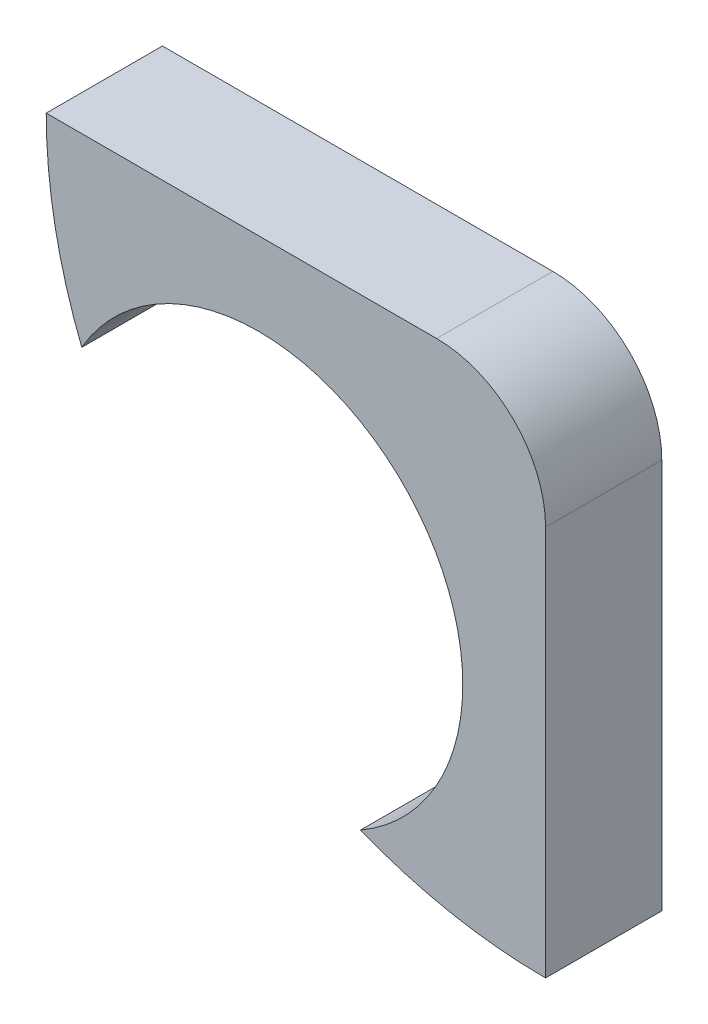
ISO-10303-21;
HEADER;
FILE_DESCRIPTION(('STEP AP214'),'2;1');
FILE_NAME('part.step','',(''),(''),'','','');
FILE_SCHEMA(('AUTOMOTIVE_DESIGN { 1 0 10303 214 1 1 1 1 }'));
ENDSEC;
DATA;
#1=APPLICATION_CONTEXT('core data for automotive mechanical design processes');
#2=APPLICATION_PROTOCOL_DEFINITION('international standard','automotive_design',2000,#1);
#3=PRODUCT_CONTEXT('',#1,'mechanical');
#4=PRODUCT('Part','Part','',(#3));
#5=PRODUCT_RELATED_PRODUCT_CATEGORY('part','',(#4));
#6=PRODUCT_DEFINITION_FORMATION('','',#4);
#7=PRODUCT_DEFINITION_CONTEXT('part definition',#1,'design');
#8=PRODUCT_DEFINITION('design','',#6,#7);
#9=PRODUCT_DEFINITION_SHAPE('','',#8);
#10=(LENGTH_UNIT() NAMED_UNIT(*) SI_UNIT(.MILLI.,.METRE.));
#11=(NAMED_UNIT(*) PLANE_ANGLE_UNIT() SI_UNIT($,.RADIAN.));
#12=(NAMED_UNIT(*) SI_UNIT($,.STERADIAN.) SOLID_ANGLE_UNIT());
#13=UNCERTAINTY_MEASURE_WITH_UNIT(LENGTH_MEASURE(1.E-05),#10,'distance_accuracy_value','');
#14=(GEOMETRIC_REPRESENTATION_CONTEXT(3) GLOBAL_UNCERTAINTY_ASSIGNED_CONTEXT((#13)) GLOBAL_UNIT_ASSIGNED_CONTEXT((#10,
#11,#12)) REPRESENTATION_CONTEXT('',''));
#15=CARTESIAN_POINT('',(0.,0.,0.));
#16=DIRECTION('',(0.,0.,1.));
#17=DIRECTION('',(1.,0.,0.));
#18=AXIS2_PLACEMENT_3D('',#15,#16,#17);
#19=CARTESIAN_POINT('',(19.95,19.95,18.95));
#20=DIRECTION('',(0.,0.,1.));
#21=DIRECTION('',(1.,0.,0.));
#22=AXIS2_PLACEMENT_3D('',#19,#20,#21);
#23=PLANE('',#22);
#24=CARTESIAN_POINT('',(19.95,19.95,18.95));
#25=DIRECTION('',(0.,0.,1.));
#26=DIRECTION('',(1.,0.,0.));
#27=AXIS2_PLACEMENT_3D('',#24,#25,#26);
#28=CIRCLE('',#27,6.875);
#29=CARTESIAN_POINT('',(17.4018583423999,13.5646574803852,18.95));
#30=VERTEX_POINT('',#29);
#31=CARTESIAN_POINT('',(19.95,13.0750000000002,18.95));
#32=VERTEX_POINT('',#31);
#33=EDGE_CURVE('E85',#30,#32,#28,.T.);
#34=ORIENTED_EDGE('',*,*,#33,.F.);
#35=CARTESIAN_POINT('',(16.,16.,18.95));
#36=DIRECTION('',(0.,0.,-1.));
#37=DIRECTION('',(1.,0.,0.));
#38=AXIS2_PLACEMENT_3D('',#35,#36,#37);
#39=CIRCLE('',#38,2.81);
#40=CARTESIAN_POINT('',(13.564657480385,17.4018583423996,18.95));
#41=VERTEX_POINT('',#40);
#42=EDGE_CURVE('E28',#41,#30,#39,.T.);
#43=ORIENTED_EDGE('',*,*,#42,.F.);
#44=CARTESIAN_POINT('',(19.95,19.95,18.95));
#45=DIRECTION('',(0.,0.,1.));
#46=DIRECTION('',(1.,0.,0.));
#47=AXIS2_PLACEMENT_3D('',#44,#45,#46);
#48=CIRCLE('',#47,6.875);
#49=CARTESIAN_POINT('',(13.0749999999998,19.95,18.95));
#50=VERTEX_POINT('',#49);
#51=EDGE_CURVE('E21',#50,#41,#48,.T.);
#52=ORIENTED_EDGE('',*,*,#51,.F.);
#53=DIRECTION('',(-1.,0.,0.));
#54=VECTOR('',#53,1.);
#55=CARTESIAN_POINT('',(18.45,19.95,18.95));
#56=LINE('',#55,#54);
#57=CARTESIAN_POINT('',(18.45,19.95,18.95));
#58=VERTEX_POINT('',#57);
#59=EDGE_CURVE('E134',#58,#50,#56,.T.);
#60=ORIENTED_EDGE('',*,*,#59,.F.);
#61=CARTESIAN_POINT('',(18.45,18.45,18.95));
#62=DIRECTION('',(0.,0.,1.));
#63=DIRECTION('',(1.,0.,0.));
#64=AXIS2_PLACEMENT_3D('',#61,#62,#63);
#65=CIRCLE('',#64,1.5);
#66=CARTESIAN_POINT('',(19.95,18.45,18.95));
#67=VERTEX_POINT('',#66);
#68=EDGE_CURVE('E87',#67,#58,#65,.T.);
#69=ORIENTED_EDGE('',*,*,#68,.F.);
#70=DIRECTION('',(0.,1.,0.));
#71=VECTOR('',#70,1.);
#72=CARTESIAN_POINT('',(19.95,13.0750000000002,18.95));
#73=LINE('',#72,#71);
#74=EDGE_CURVE('E82',#32,#67,#73,.T.);
#75=ORIENTED_EDGE('',*,*,#74,.F.);
#76=EDGE_LOOP('',(#34,#43,#52,#60,#69,#75));
#77=FACE_BOUND('',#76,.T.);
#78=ADVANCED_FACE('F17',(#77),#23,.F.);
#79=CARTESIAN_POINT('',(19.95,19.95,20.55));
#80=DIRECTION('',(0.,0.,1.));
#81=DIRECTION('',(1.,0.,0.));
#82=AXIS2_PLACEMENT_3D('',#79,#80,#81);
#83=PLANE('',#82);
#84=CARTESIAN_POINT('',(19.95,19.95,20.55));
#85=DIRECTION('',(0.,0.,1.));
#86=DIRECTION('',(1.,0.,0.));
#87=AXIS2_PLACEMENT_3D('',#84,#85,#86);
#88=CIRCLE('',#87,6.875);
#89=CARTESIAN_POINT('',(17.4018583423999,13.5646574803852,20.55));
#90=VERTEX_POINT('',#89);
#91=CARTESIAN_POINT('',(19.95,13.0750000000002,20.55));
#92=VERTEX_POINT('',#91);
#93=EDGE_CURVE('E104',#90,#92,#88,.T.);
#94=ORIENTED_EDGE('',*,*,#93,.T.);
#95=DIRECTION('',(0.,1.,0.));
#96=VECTOR('',#95,1.);
#97=CARTESIAN_POINT('',(19.95,13.0750000000002,20.55));
#98=LINE('',#97,#96);
#99=CARTESIAN_POINT('',(19.95,18.45,20.55));
#100=VERTEX_POINT('',#99);
#101=EDGE_CURVE('E99',#92,#100,#98,.T.);
#102=ORIENTED_EDGE('',*,*,#101,.T.);
#103=CARTESIAN_POINT('',(18.45,18.45,20.55));
#104=DIRECTION('',(0.,0.,1.));
#105=DIRECTION('',(1.,0.,0.));
#106=AXIS2_PLACEMENT_3D('',#103,#104,#105);
#107=CIRCLE('',#106,1.5);
#108=CARTESIAN_POINT('',(18.45,19.95,20.55));
#109=VERTEX_POINT('',#108);
#110=EDGE_CURVE('E122',#100,#109,#107,.T.);
#111=ORIENTED_EDGE('',*,*,#110,.T.);
#112=DIRECTION('',(-1.,0.,0.));
#113=VECTOR('',#112,1.);
#114=CARTESIAN_POINT('',(18.45,19.95,20.55));
#115=LINE('',#114,#113);
#116=CARTESIAN_POINT('',(13.0749999999998,19.95,20.55));
#117=VERTEX_POINT('',#116);
#118=EDGE_CURVE('E141',#109,#117,#115,.T.);
#119=ORIENTED_EDGE('',*,*,#118,.T.);
#120=CARTESIAN_POINT('',(19.95,19.95,20.55));
#121=DIRECTION('',(0.,0.,1.));
#122=DIRECTION('',(1.,0.,0.));
#123=AXIS2_PLACEMENT_3D('',#120,#121,#122);
#124=CIRCLE('',#123,6.875);
#125=CARTESIAN_POINT('',(13.564657480385,17.4018583423996,20.55));
#126=VERTEX_POINT('',#125);
#127=EDGE_CURVE('E146',#117,#126,#124,.T.);
#128=ORIENTED_EDGE('',*,*,#127,.T.);
#129=CARTESIAN_POINT('',(16.,16.,20.55));
#130=DIRECTION('',(0.,0.,-1.));
#131=DIRECTION('',(1.,0.,0.));
#132=AXIS2_PLACEMENT_3D('',#129,#130,#131);
#133=CIRCLE('',#132,2.81);
#134=EDGE_CURVE('E11',#126,#90,#133,.T.);
#135=ORIENTED_EDGE('',*,*,#134,.T.);
#136=EDGE_LOOP('',(#94,#102,#111,#119,#128,#135));
#137=FACE_BOUND('',#136,.T.);
#138=ADVANCED_FACE('F291',(#137),#83,.T.);
#139=CARTESIAN_POINT('',(16.,16.,20.55));
#140=DIRECTION('',(0.,0.,-1.));
#141=DIRECTION('',(-1.,0.,0.));
#142=AXIS2_PLACEMENT_3D('',#139,#140,#141);
#143=CYLINDRICAL_SURFACE('',#142,2.81);
#144=ORIENTED_EDGE('',*,*,#42,.T.);
#145=DIRECTION('',(0.,0.,-1.));
#146=VECTOR('',#145,1.);
#147=CARTESIAN_POINT('',(17.4018583423999,13.5646574803852,20.55));
#148=LINE('',#147,#146);
#149=EDGE_CURVE('E93',#90,#30,#148,.T.);
#150=ORIENTED_EDGE('',*,*,#149,.F.);
#151=ORIENTED_EDGE('',*,*,#134,.F.);
#152=DIRECTION('',(0.,0.,-1.));
#153=VECTOR('',#152,1.);
#154=CARTESIAN_POINT('',(13.564657480385,17.4018583423996,20.55));
#155=LINE('',#154,#153);
#156=EDGE_CURVE('E149',#126,#41,#155,.T.);
#157=ORIENTED_EDGE('',*,*,#156,.T.);
#158=EDGE_LOOP('',(#144,#150,#151,#157));
#159=FACE_BOUND('',#158,.T.);
#160=ADVANCED_FACE('F295',(#159),#143,.F.);
#161=CARTESIAN_POINT('',(19.95,19.95,20.55));
#162=DIRECTION('',(0.,0.,-1.));
#163=DIRECTION('',(-1.,0.,0.));
#164=AXIS2_PLACEMENT_3D('',#161,#162,#163);
#165=CYLINDRICAL_SURFACE('',#164,6.875);
#166=ORIENTED_EDGE('',*,*,#51,.T.);
#167=ORIENTED_EDGE('',*,*,#156,.F.);
#168=ORIENTED_EDGE('',*,*,#127,.F.);
#169=DIRECTION('',(0.,0.,-1.));
#170=VECTOR('',#169,1.);
#171=CARTESIAN_POINT('',(13.0749999999998,19.95,20.55));
#172=LINE('',#171,#170);
#173=EDGE_CURVE('E136',#117,#50,#172,.T.);
#174=ORIENTED_EDGE('',*,*,#173,.T.);
#175=EDGE_LOOP('',(#166,#167,#168,#174));
#176=FACE_BOUND('',#175,.T.);
#177=ADVANCED_FACE('F161',(#176),#165,.T.);
#178=CARTESIAN_POINT('',(18.45,19.95,20.55));
#179=DIRECTION('',(0.,-1.,0.));
#180=DIRECTION('',(0.,0.,-1.));
#181=AXIS2_PLACEMENT_3D('',#178,#179,#180);
#182=PLANE('',#181);
#183=ORIENTED_EDGE('',*,*,#59,.T.);
#184=ORIENTED_EDGE('',*,*,#173,.F.);
#185=ORIENTED_EDGE('',*,*,#118,.F.);
#186=DIRECTION('',(0.,0.,-1.));
#187=VECTOR('',#186,1.);
#188=CARTESIAN_POINT('',(18.45,19.95,20.55));
#189=LINE('',#188,#187);
#190=EDGE_CURVE('E114',#109,#58,#189,.T.);
#191=ORIENTED_EDGE('',*,*,#190,.T.);
#192=EDGE_LOOP('',(#183,#184,#185,#191));
#193=FACE_BOUND('',#192,.T.);
#194=ADVANCED_FACE('F274',(#193),#182,.F.);
#195=CARTESIAN_POINT('',(18.45,18.45,20.55));
#196=DIRECTION('',(0.,0.,-1.));
#197=DIRECTION('',(-1.,0.,0.));
#198=AXIS2_PLACEMENT_3D('',#195,#196,#197);
#199=CYLINDRICAL_SURFACE('',#198,1.5);
#200=ORIENTED_EDGE('',*,*,#68,.T.);
#201=ORIENTED_EDGE('',*,*,#190,.F.);
#202=ORIENTED_EDGE('',*,*,#110,.F.);
#203=DIRECTION('',(0.,0.,-1.));
#204=VECTOR('',#203,1.);
#205=CARTESIAN_POINT('',(19.95,18.45,20.55));
#206=LINE('',#205,#204);
#207=EDGE_CURVE('E92',#100,#67,#206,.T.);
#208=ORIENTED_EDGE('',*,*,#207,.T.);
#209=EDGE_LOOP('',(#200,#201,#202,#208));
#210=FACE_BOUND('',#209,.T.);
#211=ADVANCED_FACE('F270',(#210),#199,.T.);
#212=CARTESIAN_POINT('',(19.95,13.0750000000002,20.55));
#213=DIRECTION('',(-1.,0.,0.));
#214=DIRECTION('',(0.,0.,1.));
#215=AXIS2_PLACEMENT_3D('',#212,#213,#214);
#216=PLANE('',#215);
#217=ORIENTED_EDGE('',*,*,#74,.T.);
#218=ORIENTED_EDGE('',*,*,#207,.F.);
#219=ORIENTED_EDGE('',*,*,#101,.F.);
#220=DIRECTION('',(0.,0.,-1.));
#221=VECTOR('',#220,1.);
#222=CARTESIAN_POINT('',(19.95,13.0750000000002,20.55));
#223=LINE('',#222,#221);
#224=EDGE_CURVE('E96',#92,#32,#223,.T.);
#225=ORIENTED_EDGE('',*,*,#224,.T.);
#226=EDGE_LOOP('',(#217,#218,#219,#225));
#227=FACE_BOUND('',#226,.T.);
#228=ADVANCED_FACE('F97',(#227),#216,.F.);
#229=CARTESIAN_POINT('',(19.95,19.95,20.55));
#230=DIRECTION('',(0.,0.,-1.));
#231=DIRECTION('',(-1.,0.,0.));
#232=AXIS2_PLACEMENT_3D('',#229,#230,#231);
#233=CYLINDRICAL_SURFACE('',#232,6.875);
#234=ORIENTED_EDGE('',*,*,#33,.T.);
#235=ORIENTED_EDGE('',*,*,#224,.F.);
#236=ORIENTED_EDGE('',*,*,#93,.F.);
#237=ORIENTED_EDGE('',*,*,#149,.T.);
#238=EDGE_LOOP('',(#234,#235,#236,#237));
#239=FACE_BOUND('',#238,.T.);
#240=ADVANCED_FACE('F19',(#239),#233,.T.);
#241=CLOSED_SHELL('',(#78,#138,#160,#177,#194,#211,#228,#240));
#242=MANIFOLD_SOLID_BREP('B1',#241);
#243=ADVANCED_BREP_SHAPE_REPRESENTATION('',(#18,#242),#14);
#244=SHAPE_DEFINITION_REPRESENTATION(#9,#243);
ENDSEC;
END-ISO-10303-21;
